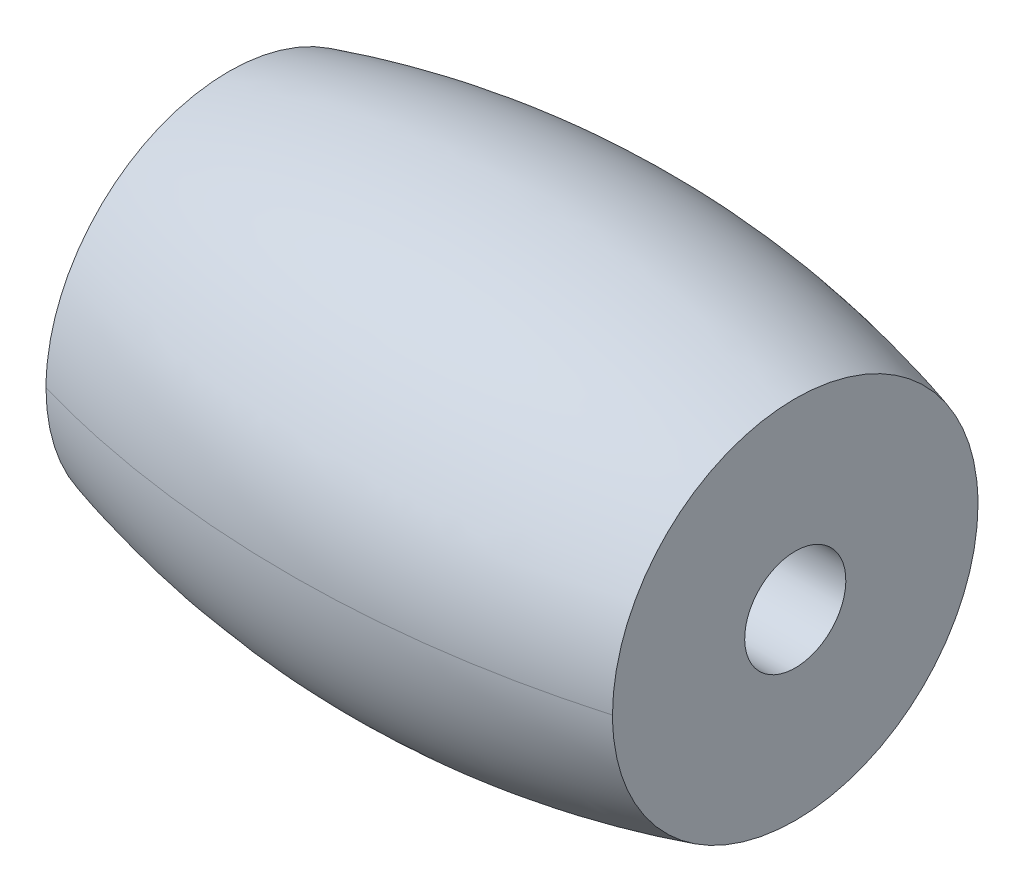
ISO-10303-21;
HEADER;
FILE_DESCRIPTION(('STEP AP214'),'2;1');
FILE_NAME('part.step','',(''),(''),'','','');
FILE_SCHEMA(('AUTOMOTIVE_DESIGN { 1 0 10303 214 1 1 1 1 }'));
ENDSEC;
DATA;
#1=APPLICATION_CONTEXT('core data for automotive mechanical design processes');
#2=APPLICATION_PROTOCOL_DEFINITION('international standard','automotive_design',2000,#1);
#3=PRODUCT_CONTEXT('',#1,'mechanical');
#4=PRODUCT('Part','Part','',(#3));
#5=PRODUCT_RELATED_PRODUCT_CATEGORY('part','',(#4));
#6=PRODUCT_DEFINITION_FORMATION('','',#4);
#7=PRODUCT_DEFINITION_CONTEXT('part definition',#1,'design');
#8=PRODUCT_DEFINITION('design','',#6,#7);
#9=PRODUCT_DEFINITION_SHAPE('','',#8);
#10=(LENGTH_UNIT() NAMED_UNIT(*) SI_UNIT(.MILLI.,.METRE.));
#11=(NAMED_UNIT(*) PLANE_ANGLE_UNIT() SI_UNIT($,.RADIAN.));
#12=(NAMED_UNIT(*) SI_UNIT($,.STERADIAN.) SOLID_ANGLE_UNIT());
#13=UNCERTAINTY_MEASURE_WITH_UNIT(LENGTH_MEASURE(1.E-05),#10,'distance_accuracy_value','');
#14=(GEOMETRIC_REPRESENTATION_CONTEXT(3) GLOBAL_UNCERTAINTY_ASSIGNED_CONTEXT((#13)) GLOBAL_UNIT_ASSIGNED_CONTEXT((#10,
#11,#12)) REPRESENTATION_CONTEXT('',''));
#15=CARTESIAN_POINT('',(0.,0.,0.));
#16=DIRECTION('',(0.,0.,1.));
#17=DIRECTION('',(1.,0.,0.));
#18=AXIS2_PLACEMENT_3D('',#15,#16,#17);
#19=CARTESIAN_POINT('',(7.,19.9,4.516387939));
#20=CARTESIAN_POINT('',(7.,10.867224121,4.516387939));
#21=CARTESIAN_POINT('',(7.,10.867224121,-4.516387939));
#22=CARTESIAN_POINT('',(7.,19.9,-4.516387939));
#23=CARTESIAN_POINT('',(2.395168413,19.9,5.836559506));
#24=CARTESIAN_POINT('',(2.395168413,8.226880989,5.836559506));
#25=CARTESIAN_POINT('',(2.395168413,8.226880989,-5.836559506));
#26=CARTESIAN_POINT('',(2.395168413,19.9,-5.836559506));
#27=CARTESIAN_POINT('',(-2.395168413,19.9,5.836559506));
#28=CARTESIAN_POINT('',(-2.395168413,8.226880989,5.836559506));
#29=CARTESIAN_POINT('',(-2.395168413,8.226880989,-5.836559506));
#30=CARTESIAN_POINT('',(-2.395168413,19.9,-5.836559506));
#31=CARTESIAN_POINT('',(-7.,19.9,4.516387939));
#32=CARTESIAN_POINT('',(-7.,10.867224121,4.516387939));
#33=CARTESIAN_POINT('',(-7.,10.867224121,-4.516387939));
#34=CARTESIAN_POINT('',(-7.,19.9,-4.516387939));
#35=(BOUNDED_SURFACE() B_SPLINE_SURFACE(3,3,((#19,#20,#21,#22),(#23,#24,#25,#26),(#27,#28,#29,
#30),(#31,#32,#33,#34)),.UNSPECIFIED.,.F.,.F.,.F.) B_SPLINE_SURFACE_WITH_KNOTS((4,4),(4,4),(0.,
1.),(0.,1.),.UNSPECIFIED.) GEOMETRIC_REPRESENTATION_ITEM() RATIONAL_B_SPLINE_SURFACE(((1.,
0.333333333333333,0.333333333333333,1.),(0.974183410479028,0.324727803493009,0.324727803493009,
0.974183410479028),(0.974183410479028,0.324727803493009,0.324727803493009,0.974183410479028),
(1.,0.333333333333333,0.333333333333333,1.))) REPRESENTATION_ITEM('') SURFACE());
#36=CARTESIAN_POINT('',(7.,19.9,-4.516387939));
#37=CARTESIAN_POINT('',(2.395168413,19.9,-5.836559506));
#38=CARTESIAN_POINT('',(-2.395168413,19.9,-5.836559506));
#39=CARTESIAN_POINT('',(-7.,19.9,-4.516387939));
#40=(BOUNDED_CURVE() B_SPLINE_CURVE(3,(#36,#37,#38,#39),.UNSPECIFIED.,.F.,
.F.) B_SPLINE_CURVE_WITH_KNOTS((4,4),(0.,1.),
.UNSPECIFIED.) CURVE() GEOMETRIC_REPRESENTATION_ITEM() RATIONAL_B_SPLINE_CURVE((1.,
0.974183410479028,0.974183410479028,1.)) REPRESENTATION_ITEM(''));
#41=CARTESIAN_POINT('',(7.,19.9,-4.516387939));
#42=VERTEX_POINT('',#41);
#43=CARTESIAN_POINT('',(-7.,19.9,-4.516387939));
#44=VERTEX_POINT('',#43);
#45=EDGE_CURVE('E52',#42,#44,#40,.T.);
#46=CARTESIAN_POINT('',(7.,19.9,-4.516387939));
#47=CARTESIAN_POINT('',(7.,19.7729751648833,-4.51640159673756));
#48=CARTESIAN_POINT('',(7.,19.6459522931038,-4.51102959194));
#49=CARTESIAN_POINT('',(7.,19.3928153096737,-4.48961290198438));
#50=CARTESIAN_POINT('',(7.,19.2667011548022,-4.47356872785502));
#51=CARTESIAN_POINT('',(7.,19.0163621174745,-4.43092132055707));
#52=CARTESIAN_POINT('',(7.,18.892135969324,-4.4043255174868));
#53=CARTESIAN_POINT('',(7.,18.6463659665743,-4.34076833961015));
#54=CARTESIAN_POINT('',(7.,18.5248220794003,-4.30380709076226));
#55=CARTESIAN_POINT('',(7.,18.2852442976578,-4.21976827385078));
#56=CARTESIAN_POINT('',(7.,18.167211418387,-4.17268781131836));
#57=CARTESIAN_POINT('',(7.,17.9354881222293,-4.06873253837329));
#58=CARTESIAN_POINT('',(7.,17.8217993258206,-4.01185411576629));
#59=CARTESIAN_POINT('',(7.,17.5996819503382,-3.88875433273147));
#60=CARTESIAN_POINT('',(7.,17.4912504316352,-3.82253827636791));
#61=CARTESIAN_POINT('',(7.,17.2803102476377,-3.68118333811818));
#62=CARTESIAN_POINT('',(7.,17.1778037830855,-3.60604117206736));
#63=CARTESIAN_POINT('',(7.,16.9795204518188,-3.44741544728942));
#64=CARTESIAN_POINT('',(7.,16.8837412625771,-3.36393479169432));
#65=CARTESIAN_POINT('',(7.,16.6995198851023,-3.18917119821299));
#66=CARTESIAN_POINT('',(7.,16.6110804192318,-3.09788539059502));
#67=CARTESIAN_POINT('',(7.,16.4422252195474,-2.90820778794242));
#68=CARTESIAN_POINT('',(7.,16.3618077516524,-2.80981753660691));
#69=CARTESIAN_POINT('',(7.,16.2095181829972,-2.60657529745303));
#70=CARTESIAN_POINT('',(7.,16.1376492489454,-2.50172093678107));
#71=CARTESIAN_POINT('',(7.,16.0030303221981,-2.28637374127166));
#72=CARTESIAN_POINT('',(7.,15.9402765731438,-2.17588325458546));
#73=CARTESIAN_POINT('',(7.,15.8242771963529,-1.94996744016067));
#74=CARTESIAN_POINT('',(7.,15.7710350867623,-1.8345403059492));
#75=CARTESIAN_POINT('',(7.,15.6744870689274,-1.59966120670978));
#76=CARTESIAN_POINT('',(7.,15.6311768732621,-1.48021100400131));
#77=CARTESIAN_POINT('',(7.,15.5547568820231,-1.23804262883616));
#78=CARTESIAN_POINT('',(7.,15.5216508461452,-1.11532326991713));
#79=CARTESIAN_POINT('',(7.,15.4659056333206,-0.867573418915544));
#80=CARTESIAN_POINT('',(7.,15.4432629304349,-0.742543720164557));
#81=CARTESIAN_POINT('',(7.,15.4085827887488,-0.490977681574806));
#82=CARTESIAN_POINT('',(7.,15.3965490406356,-0.36444083292568));
#83=CARTESIAN_POINT('',(7.,15.3831868272065,-0.110822322245486));
#84=CARTESIAN_POINT('',(7.,15.381856748042,0.0162592547629603));
#85=CARTESIAN_POINT('',(7.,15.3899070810211,0.270082712146288));
#86=CARTESIAN_POINT('',(7.,15.3992874932217,0.396824592519366));
#87=CARTESIAN_POINT('',(7.,15.4286945432784,0.649088282946617));
#88=CARTESIAN_POINT('',(7.,15.4487229258584,0.774609889619529));
#89=CARTESIAN_POINT('',(7.,15.4992757415498,1.02347589511249));
#90=CARTESIAN_POINT('',(7.,15.529796523576,1.1468210356111));
#91=CARTESIAN_POINT('',(7.,15.6011314026388,1.39054560331667));
#92=CARTESIAN_POINT('',(7.,15.641949146961,1.51092396304108));
#93=CARTESIAN_POINT('',(7.,15.7335653915954,1.74776976144102));
#94=CARTESIAN_POINT('',(7.,15.7843602144618,1.86423862265153));
#95=CARTESIAN_POINT('',(7.,15.895601156348,2.09252934372251));
#96=CARTESIAN_POINT('',(7.,15.9560510784663,2.20434935045593));
#97=CARTESIAN_POINT('',(7.,16.086133838824,2.42245788781974));
#98=CARTESIAN_POINT('',(7.,16.1557632799895,2.5287484445442));
#99=CARTESIAN_POINT('',(7.,16.3037511746016,2.7351200980187));
#100=CARTESIAN_POINT('',(7.,16.3821124130562,2.8351991976857));
#101=CARTESIAN_POINT('',(7.,16.5469580043105,3.02836343481878));
#102=CARTESIAN_POINT('',(7.,16.6334393479379,3.12145114033799));
#103=CARTESIAN_POINT('',(7.,16.8139562544225,3.30003291236185));
#104=CARTESIAN_POINT('',(7.,16.9079935845942,3.38552519242371));
#105=CARTESIAN_POINT('',(7.,17.1029001699545,3.54825364387103));
#106=CARTESIAN_POINT('',(7.,17.2037668918145,3.62549284957859));
#107=CARTESIAN_POINT('',(7.,17.4117181860578,3.77125272519666));
#108=CARTESIAN_POINT('',(7.,17.5188069870377,3.83976736242896));
#109=CARTESIAN_POINT('',(7.,17.7383369074483,3.96750479073464));
#110=CARTESIAN_POINT('',(7.,17.8507760365421,4.02673100244624));
#111=CARTESIAN_POINT('',(7.,18.0803564054436,4.1355544556805));
#112=CARTESIAN_POINT('',(7.,18.1975021534516,4.18514218627831));
#113=CARTESIAN_POINT('',(7.,18.435513881342,4.27424624500391));
#114=CARTESIAN_POINT('',(7.,18.5563784456015,4.31376635363823));
#115=CARTESIAN_POINT('',(7.,18.8008704569381,4.38244012705406));
#116=CARTESIAN_POINT('',(7.,18.9244947131807,4.41160516548883));
#117=CARTESIAN_POINT('',(7.,19.1737109053091,4.45941145911127));
#118=CARTESIAN_POINT('',(7.,19.2993018441055,4.47805788024886));
#119=CARTESIAN_POINT('',(7.,19.5043050953678,4.49971994857918));
#120=CARTESIAN_POINT('',(7.,19.5833892533729,4.50597442899889));
#121=CARTESIAN_POINT('',(7.,19.7416461966431,4.51430543095316));
#122=CARTESIAN_POINT('',(7.,19.820818619263,4.51638884220867));
#123=CARTESIAN_POINT('',(7.,19.9,4.516387939));
#124=B_SPLINE_CURVE_WITH_KNOTS('',3,(#46,#47,#48,#49,#50,#51,#52,#53,#54,#55,#56,#57,#58,#59,
#60,#61,#62,#63,#64,#65,#66,#67,#68,#69,#70,#71,#72,#73,#74,#75,#76,#77,#78,#79,#80,#81,#82,#83,
#84,#85,#86,#87,#88,#89,#90,#91,#92,#93,#94,#95,#96,#97,#98,#99,#100,#101,#102,#103,#104,#105,
#106,#107,#108,#109,#110,#111,#112,#113,#114,#115,#116,#117,#118,#119,#120,#121,#122,#123),
.UNSPECIFIED.,.F.,.F.,(4,2,2,2,2,2,2,2,2,2,2,2,2,2,2,2,2,2,2,2,2,2,2,2,2,2,2,2,2,2,2,2,2,2,2,2,
2,2,4),(0.,0.380958192129953,0.761898143679951,1.14257032502025,1.52323788072024,
1.90401446664994,2.28493173434005,2.66563349436249,3.04647576156624,3.42718589370098,
3.80803660901416,4.18880481823044,4.56971364234561,4.95046504622623,5.33135699138984,
5.71208420182319,6.09295152297124,6.47369040550699,6.85456168885535,7.2353755451529,
7.61618940347316,7.99706567931083,8.3778095539246,8.75868848159891,9.13942728387773,
9.52031642893226,9.90106501156788,10.2819353835101,10.6626651643127,11.0434842569334,
11.4241628524685,11.8051032584597,12.1859030448418,12.5670767048282,12.9481070180779,
13.3287175165254,13.7091409247519,13.9470331209038,14.1845320443632),.UNSPECIFIED.);
#125=CARTESIAN_POINT('',(7.,19.9,4.516387939));
#126=VERTEX_POINT('',#125);
#127=EDGE_CURVE('E60',#42,#126,#124,.T.);
#128=CARTESIAN_POINT('',(7.,19.9,4.516387939));
#129=CARTESIAN_POINT('',(2.395168413,19.9,5.836559506));
#130=CARTESIAN_POINT('',(-2.395168413,19.9,5.836559506));
#131=CARTESIAN_POINT('',(-7.,19.9,4.516387939));
#132=(BOUNDED_CURVE() B_SPLINE_CURVE(3,(#128,#129,#130,#131),.UNSPECIFIED.,.F.,
.F.) B_SPLINE_CURVE_WITH_KNOTS((4,4),(0.,1.),
.UNSPECIFIED.) CURVE() GEOMETRIC_REPRESENTATION_ITEM() RATIONAL_B_SPLINE_CURVE((1.,
0.974183410479028,0.974183410479028,1.)) REPRESENTATION_ITEM(''));
#133=CARTESIAN_POINT('',(-7.,19.9,4.516387939));
#134=VERTEX_POINT('',#133);
#135=EDGE_CURVE('E41',#134,#126,#132,.F.);
#136=CARTESIAN_POINT('',(-7.,19.9,4.516387939));
#137=CARTESIAN_POINT('',(-7.,19.7729751648833,4.51640159673756));
#138=CARTESIAN_POINT('',(-7.,19.6459522931038,4.51102959194));
#139=CARTESIAN_POINT('',(-7.,19.3928153096737,4.48961290198438));
#140=CARTESIAN_POINT('',(-7.,19.2667011548022,4.47356872785502));
#141=CARTESIAN_POINT('',(-7.,19.0163621174745,4.43092132055707));
#142=CARTESIAN_POINT('',(-7.,18.892135969324,4.4043255174868));
#143=CARTESIAN_POINT('',(-7.,18.6463659665743,4.34076833961015));
#144=CARTESIAN_POINT('',(-7.,18.5248220794004,4.30380709076226));
#145=CARTESIAN_POINT('',(-7.,18.2852442976578,4.21976827385078));
#146=CARTESIAN_POINT('',(-7.,18.167211418387,4.17268781131836));
#147=CARTESIAN_POINT('',(-7.,17.9354881222293,4.06873253837329));
#148=CARTESIAN_POINT('',(-7.,17.8217993258206,4.0118541157663));
#149=CARTESIAN_POINT('',(-7.,17.5996819503382,3.88875433273147));
#150=CARTESIAN_POINT('',(-7.,17.4912504316352,3.82253827636792));
#151=CARTESIAN_POINT('',(-7.,17.2803102476377,3.68118333811819));
#152=CARTESIAN_POINT('',(-7.,17.1778037830855,3.60604117206736));
#153=CARTESIAN_POINT('',(-7.,16.9795204518188,3.44741544728942));
#154=CARTESIAN_POINT('',(-7.,16.8837412625771,3.36393479169433));
#155=CARTESIAN_POINT('',(-7.,16.6995198851023,3.189171198213));
#156=CARTESIAN_POINT('',(-7.,16.6110804192318,3.09788539059503));
#157=CARTESIAN_POINT('',(-7.,16.4422252195474,2.90820778794243));
#158=CARTESIAN_POINT('',(-7.,16.3618077516524,2.80981753660692));
#159=CARTESIAN_POINT('',(-7.,16.2095181829972,2.60657529745304));
#160=CARTESIAN_POINT('',(-7.,16.1376492489454,2.50172093678108));
#161=CARTESIAN_POINT('',(-7.,16.0030303221981,2.28637374127167));
#162=CARTESIAN_POINT('',(-7.,15.9402765731438,2.17588325458547));
#163=CARTESIAN_POINT('',(-7.,15.8242771963529,1.94996744016068));
#164=CARTESIAN_POINT('',(-7.,15.7710350867623,1.8345403059492));
#165=CARTESIAN_POINT('',(-7.,15.6744870689274,1.59966120670978));
#166=CARTESIAN_POINT('',(-7.,15.6311768732621,1.48021100400132));
#167=CARTESIAN_POINT('',(-7.,15.5547568820231,1.23804262883617));
#168=CARTESIAN_POINT('',(-7.,15.5216508461452,1.11532326991714));
#169=CARTESIAN_POINT('',(-7.,15.4659056333206,0.867573418915549));
#170=CARTESIAN_POINT('',(-7.,15.4432629304349,0.742543720164562));
#171=CARTESIAN_POINT('',(-7.,15.4085827887488,0.49097768157481));
#172=CARTESIAN_POINT('',(-7.,15.3965490406356,0.364440832925685));
#173=CARTESIAN_POINT('',(-7.,15.3831868272065,0.11082232224549));
#174=CARTESIAN_POINT('',(-7.,15.381856748042,-0.0162592547629555));
#175=CARTESIAN_POINT('',(-7.,15.3899070810211,-0.270082712146284));
#176=CARTESIAN_POINT('',(-7.,15.3992874932217,-0.396824592519362));
#177=CARTESIAN_POINT('',(-7.,15.4286945432784,-0.649088282946613));
#178=CARTESIAN_POINT('',(-7.,15.4487229258584,-0.774609889619524));
#179=CARTESIAN_POINT('',(-7.,15.4992757415498,-1.02347589511249));
#180=CARTESIAN_POINT('',(-7.,15.529796523576,-1.1468210356111));
#181=CARTESIAN_POINT('',(-7.,15.6011314026388,-1.39054560331667));
#182=CARTESIAN_POINT('',(-7.,15.641949146961,-1.51092396304108));
#183=CARTESIAN_POINT('',(-7.,15.7335653915954,-1.74776976144102));
#184=CARTESIAN_POINT('',(-7.,15.7843602144618,-1.86423862265153));
#185=CARTESIAN_POINT('',(-7.,15.895601156348,-2.09252934372251));
#186=CARTESIAN_POINT('',(-7.,15.9560510784663,-2.20434935045593));
#187=CARTESIAN_POINT('',(-7.,16.086133838824,-2.42245788781974));
#188=CARTESIAN_POINT('',(-7.,16.1557632799895,-2.5287484445442));
#189=CARTESIAN_POINT('',(-7.,16.3037511746016,-2.7351200980187));
#190=CARTESIAN_POINT('',(-7.,16.3821124130562,-2.8351991976857));
#191=CARTESIAN_POINT('',(-7.,16.5469580043105,-3.02836343481878));
#192=CARTESIAN_POINT('',(-7.,16.6334393479379,-3.12145114033799));
#193=CARTESIAN_POINT('',(-7.,16.8139562544225,-3.30003291236185));
#194=CARTESIAN_POINT('',(-7.,16.9079935845942,-3.38552519242371));
#195=CARTESIAN_POINT('',(-7.,17.1029001699545,-3.54825364387103));
#196=CARTESIAN_POINT('',(-7.,17.2037668918145,-3.62549284957859));
#197=CARTESIAN_POINT('',(-7.,17.4117181860578,-3.77125272519667));
#198=CARTESIAN_POINT('',(-7.,17.5188069870377,-3.83976736242897));
#199=CARTESIAN_POINT('',(-7.,17.7383369074483,-3.96750479073464));
#200=CARTESIAN_POINT('',(-7.,17.8507760365421,-4.02673100244624));
#201=CARTESIAN_POINT('',(-7.,18.0803564054436,-4.13555445568051));
#202=CARTESIAN_POINT('',(-7.,18.1975021534516,-4.18514218627831));
#203=CARTESIAN_POINT('',(-7.,18.435513881342,-4.27424624500391));
#204=CARTESIAN_POINT('',(-7.,18.5563784456015,-4.31376635363823));
#205=CARTESIAN_POINT('',(-7.,18.8008704569381,-4.38244012705406));
#206=CARTESIAN_POINT('',(-7.,18.9244947131807,-4.41160516548883));
#207=CARTESIAN_POINT('',(-7.,19.1737109053091,-4.45941145911127));
#208=CARTESIAN_POINT('',(-7.,19.2993018441055,-4.47805788024886));
#209=CARTESIAN_POINT('',(-7.,19.5043050953678,-4.49971994857918));
#210=CARTESIAN_POINT('',(-7.,19.5833892533729,-4.50597442899889));
#211=CARTESIAN_POINT('',(-7.,19.7416461966431,-4.51430543095316));
#212=CARTESIAN_POINT('',(-7.,19.820818619263,-4.51638884220867));
#213=CARTESIAN_POINT('',(-7.,19.9,-4.516387939));
#214=B_SPLINE_CURVE_WITH_KNOTS('',3,(#136,#137,#138,#139,#140,#141,#142,#143,#144,#145,#146,
#147,#148,#149,#150,#151,#152,#153,#154,#155,#156,#157,#158,#159,#160,#161,#162,#163,#164,#165,
#166,#167,#168,#169,#170,#171,#172,#173,#174,#175,#176,#177,#178,#179,#180,#181,#182,#183,#184,
#185,#186,#187,#188,#189,#190,#191,#192,#193,#194,#195,#196,#197,#198,#199,#200,#201,#202,#203,
#204,#205,#206,#207,#208,#209,#210,#211,#212,#213),.UNSPECIFIED.,.F.,.F.,(4,2,2,2,2,2,2,2,2,2,2,
2,2,2,2,2,2,2,2,2,2,2,2,2,2,2,2,2,2,2,2,2,2,2,2,2,2,2,4),(0.,0.38095819212995,0.761898143679947,
1.14257032502024,1.52323788072024,1.90401446664993,2.28493173434004,2.66563349436248,
3.04647576156623,3.42718589370097,3.80803660901415,4.18880481823043,4.5697136423456,
4.95046504622622,5.33135699138983,5.71208420182318,6.09295152297123,6.47369040550699,
6.85456168885535,7.2353755451529,7.61618940347315,7.99706567931082,8.37780955392459,
8.75868848159891,9.13942728387772,9.52031642893225,9.90106501156788,10.2819353835101,
10.6626651643127,11.0434842569334,11.4241628524685,11.8051032584597,12.1859030448418,
12.5670767048282,12.9481070180779,13.3287175165254,13.7091409247519,13.9470331209038,
14.1845320443632),.UNSPECIFIED.);
#215=EDGE_CURVE('E22',#134,#44,#214,.T.);
#216=ORIENTED_EDGE('',*,*,#45,.F.);
#217=ORIENTED_EDGE('',*,*,#127,.T.);
#218=ORIENTED_EDGE('',*,*,#135,.F.);
#219=ORIENTED_EDGE('',*,*,#215,.T.);
#220=EDGE_LOOP('',(#216,#217,#218,#219));
#221=FACE_BOUND('',#220,.T.);
#222=ADVANCED_FACE('F17',(#221),#35,.T.);
#223=CARTESIAN_POINT('',(7.,19.9,-4.516387939));
#224=CARTESIAN_POINT('',(7.,28.932775879,-4.516387939));
#225=CARTESIAN_POINT('',(7.,28.932775879,4.516387939));
#226=CARTESIAN_POINT('',(7.,19.9,4.516387939));
#227=CARTESIAN_POINT('',(2.395168413,19.9,-5.836559506));
#228=CARTESIAN_POINT('',(2.395168413,31.573119011,-5.836559506));
#229=CARTESIAN_POINT('',(2.395168413,31.573119011,5.836559506));
#230=CARTESIAN_POINT('',(2.395168413,19.9,5.836559506));
#231=CARTESIAN_POINT('',(-2.395168413,19.9,-5.836559506));
#232=CARTESIAN_POINT('',(-2.395168413,31.573119011,-5.836559506));
#233=CARTESIAN_POINT('',(-2.395168413,31.573119011,5.836559506));
#234=CARTESIAN_POINT('',(-2.395168413,19.9,5.836559506));
#235=CARTESIAN_POINT('',(-7.,19.9,-4.516387939));
#236=CARTESIAN_POINT('',(-7.,28.932775879,-4.516387939));
#237=CARTESIAN_POINT('',(-7.,28.932775879,4.516387939));
#238=CARTESIAN_POINT('',(-7.,19.9,4.516387939));
#239=(BOUNDED_SURFACE() B_SPLINE_SURFACE(3,3,((#223,#224,#225,#226),(#227,#228,#229,#230),(#231,
#232,#233,#234),(#235,#236,#237,#238)),.UNSPECIFIED.,.F.,.F.,
.F.) B_SPLINE_SURFACE_WITH_KNOTS((4,4),(4,4),(0.,1.),(0.,1.),
.UNSPECIFIED.) GEOMETRIC_REPRESENTATION_ITEM() RATIONAL_B_SPLINE_SURFACE(((1.,0.333333333333333,
0.333333333333333,1.),(0.974183410479028,0.324727803493009,0.324727803493009,0.974183410479028),
(0.974183410479028,0.324727803493009,0.324727803493009,0.974183410479028),(1.,0.333333333333333,
0.333333333333333,1.))) REPRESENTATION_ITEM('') SURFACE());
#240=CARTESIAN_POINT('',(7.,19.9,4.516387939));
#241=CARTESIAN_POINT('',(7.,20.0270248351167,4.51640159673756));
#242=CARTESIAN_POINT('',(7.,20.1540477068962,4.51102959194));
#243=CARTESIAN_POINT('',(7.,20.4071846903263,4.48961290198438));
#244=CARTESIAN_POINT('',(7.,20.5332988451978,4.47356872785503));
#245=CARTESIAN_POINT('',(7.,20.7836378825255,4.43092132055707));
#246=CARTESIAN_POINT('',(7.,20.907864030676,4.4043255174868));
#247=CARTESIAN_POINT('',(7.,21.1536340334257,4.34076833961015));
#248=CARTESIAN_POINT('',(7.,21.2751779205996,4.30380709076226));
#249=CARTESIAN_POINT('',(7.,21.5147557023422,4.21976827385078));
#250=CARTESIAN_POINT('',(7.,21.632788581613,4.17268781131836));
#251=CARTESIAN_POINT('',(7.,21.8645118777707,4.06873253837329));
#252=CARTESIAN_POINT('',(7.,21.9782006741794,4.0118541157663));
#253=CARTESIAN_POINT('',(7.,22.2003180496618,3.88875433273147));
#254=CARTESIAN_POINT('',(7.,22.3087495683648,3.82253827636792));
#255=CARTESIAN_POINT('',(7.,22.5196897523623,3.68118333811819));
#256=CARTESIAN_POINT('',(7.,22.6221962169145,3.60604117206736));
#257=CARTESIAN_POINT('',(7.,22.8204795481812,3.44741544728942));
#258=CARTESIAN_POINT('',(7.,22.9162587374229,3.36393479169433));
#259=CARTESIAN_POINT('',(7.,23.1004801148977,3.189171198213));
#260=CARTESIAN_POINT('',(7.,23.1889195807682,3.09788539059502));
#261=CARTESIAN_POINT('',(7.,23.3577747804526,2.90820778794242));
#262=CARTESIAN_POINT('',(7.,23.4381922483476,2.80981753660692));
#263=CARTESIAN_POINT('',(7.,23.5904818170028,2.60657529745303));
#264=CARTESIAN_POINT('',(7.,23.6623507510546,2.50172093678107));
#265=CARTESIAN_POINT('',(7.,23.7969696778019,2.28637374127166));
#266=CARTESIAN_POINT('',(7.,23.8597234268562,2.17588325458546));
#267=CARTESIAN_POINT('',(7.,23.9757228036471,1.94996744016067));
#268=CARTESIAN_POINT('',(7.,24.0289649132377,1.83454030594919));
#269=CARTESIAN_POINT('',(7.,24.1255129310726,1.59966120670977));
#270=CARTESIAN_POINT('',(7.,24.1688231267379,1.48021100400131));
#271=CARTESIAN_POINT('',(7.,24.2452431179769,1.23804262883616));
#272=CARTESIAN_POINT('',(7.,24.2783491538548,1.11532326991713));
#273=CARTESIAN_POINT('',(7.,24.3340943666794,0.867573418915538));
#274=CARTESIAN_POINT('',(7.,24.3567370695651,0.742543720164551));
#275=CARTESIAN_POINT('',(7.,24.3914172112512,0.4909776815748));
#276=CARTESIAN_POINT('',(7.,24.4034509593644,0.364440832925675));
#277=CARTESIAN_POINT('',(7.,24.4168131727935,0.110822322245481));
#278=CARTESIAN_POINT('',(7.,24.418143251958,-0.0162592547629642));
#279=CARTESIAN_POINT('',(7.,24.4100929189789,-0.270082712146291));
#280=CARTESIAN_POINT('',(7.,24.4007125067783,-0.396824592519369));
#281=CARTESIAN_POINT('',(7.,24.3713054567216,-0.64908828294662));
#282=CARTESIAN_POINT('',(7.,24.3512770741416,-0.774609889619532));
#283=CARTESIAN_POINT('',(7.,24.3007242584502,-1.02347589511249));
#284=CARTESIAN_POINT('',(7.,24.270203476424,-1.14682103561111));
#285=CARTESIAN_POINT('',(7.,24.1988685973612,-1.39054560331667));
#286=CARTESIAN_POINT('',(7.,24.158050853039,-1.51092396304108));
#287=CARTESIAN_POINT('',(7.,24.0664346084046,-1.74776976144102));
#288=CARTESIAN_POINT('',(7.,24.0156397855382,-1.86423862265153));
#289=CARTESIAN_POINT('',(7.,23.904398843652,-2.09252934372252));
#290=CARTESIAN_POINT('',(7.,23.8439489215337,-2.20434935045594));
#291=CARTESIAN_POINT('',(7.,23.713866161176,-2.42245788781974));
#292=CARTESIAN_POINT('',(7.,23.6442367200105,-2.52874844454421));
#293=CARTESIAN_POINT('',(7.,23.4962488253984,-2.7351200980187));
#294=CARTESIAN_POINT('',(7.,23.4178875869438,-2.83519919768571));
#295=CARTESIAN_POINT('',(7.,23.2530419956895,-3.02836343481878));
#296=CARTESIAN_POINT('',(7.,23.1665606520621,-3.12145114033799));
#297=CARTESIAN_POINT('',(7.,22.9860437455774,-3.30003291236185));
#298=CARTESIAN_POINT('',(7.,22.8920064154058,-3.38552519242372));
#299=CARTESIAN_POINT('',(7.,22.6970998300455,-3.54825364387104));
#300=CARTESIAN_POINT('',(7.,22.5962331081855,-3.6254928495786));
#301=CARTESIAN_POINT('',(7.,22.3882818139422,-3.77125272519667));
#302=CARTESIAN_POINT('',(7.,22.2811930129623,-3.83976736242897));
#303=CARTESIAN_POINT('',(7.,22.0616630925517,-3.96750479073464));
#304=CARTESIAN_POINT('',(7.,21.9492239634579,-4.02673100244624));
#305=CARTESIAN_POINT('',(7.,21.7196435945563,-4.13555445568051));
#306=CARTESIAN_POINT('',(7.,21.6024978465484,-4.18514218627831));
#307=CARTESIAN_POINT('',(7.,21.364486118658,-4.27424624500391));
#308=CARTESIAN_POINT('',(7.,21.2436215543985,-4.31376635363823));
#309=CARTESIAN_POINT('',(7.,20.9991295430619,-4.38244012705406));
#310=CARTESIAN_POINT('',(7.,20.8755052868193,-4.41160516548883));
#311=CARTESIAN_POINT('',(7.,20.6262890946909,-4.45941145911127));
#312=CARTESIAN_POINT('',(7.,20.5006981558945,-4.47805788024886));
#313=CARTESIAN_POINT('',(7.,20.2956949046321,-4.49971994857918));
#314=CARTESIAN_POINT('',(7.,20.2166107466271,-4.50597442899889));
#315=CARTESIAN_POINT('',(7.,20.0583538033568,-4.51430543095316));
#316=CARTESIAN_POINT('',(7.,19.979181380737,-4.51638884220867));
#317=CARTESIAN_POINT('',(7.,19.9,-4.516387939));
#318=B_SPLINE_CURVE_WITH_KNOTS('',3,(#240,#241,#242,#243,#244,#245,#246,#247,#248,#249,#250,
#251,#252,#253,#254,#255,#256,#257,#258,#259,#260,#261,#262,#263,#264,#265,#266,#267,#268,#269,
#270,#271,#272,#273,#274,#275,#276,#277,#278,#279,#280,#281,#282,#283,#284,#285,#286,#287,#288,
#289,#290,#291,#292,#293,#294,#295,#296,#297,#298,#299,#300,#301,#302,#303,#304,#305,#306,#307,
#308,#309,#310,#311,#312,#313,#314,#315,#316,#317),.UNSPECIFIED.,.F.,.F.,(4,2,2,2,2,2,2,2,2,2,2,
2,2,2,2,2,2,2,2,2,2,2,2,2,2,2,2,2,2,2,2,2,2,2,2,2,2,2,4),(0.,0.380958192129953,0.76189814367995,
1.14257032502025,1.52323788072024,1.90401446664994,2.28493173434004,2.66563349436249,
3.04647576156624,3.42718589370098,3.80803660901416,4.18880481823044,4.56971364234561,
4.95046504622624,5.33135699138985,5.71208420182319,6.09295152297125,6.473690405507,
6.85456168885536,7.23537554515291,7.61618940347316,7.99706567931083,8.3778095539246,
8.75868848159892,9.13942728387773,9.52031642893227,9.90106501156789,10.2819353835101,
10.6626651643127,11.0434842569334,11.4241628524685,11.8051032584597,12.1859030448418,
12.5670767048282,12.9481070180779,13.3287175165254,13.7091409247519,13.9470331209038,
14.1845320443632),.UNSPECIFIED.);
#319=EDGE_CURVE('E55',#126,#42,#318,.T.);
#320=CARTESIAN_POINT('',(-7.,19.9,-4.516387939));
#321=CARTESIAN_POINT('',(-7.,20.0270248351167,-4.51640159673756));
#322=CARTESIAN_POINT('',(-7.,20.1540477068962,-4.51102959194));
#323=CARTESIAN_POINT('',(-7.,20.4071846903263,-4.48961290198438));
#324=CARTESIAN_POINT('',(-7.,20.5332988451978,-4.47356872785502));
#325=CARTESIAN_POINT('',(-7.,20.7836378825255,-4.43092132055706));
#326=CARTESIAN_POINT('',(-7.,20.907864030676,-4.4043255174868));
#327=CARTESIAN_POINT('',(-7.,21.1536340334257,-4.34076833961014));
#328=CARTESIAN_POINT('',(-7.,21.2751779205997,-4.30380709076226));
#329=CARTESIAN_POINT('',(-7.,21.5147557023422,-4.21976827385078));
#330=CARTESIAN_POINT('',(-7.,21.632788581613,-4.17268781131835));
#331=CARTESIAN_POINT('',(-7.,21.8645118777707,-4.06873253837329));
#332=CARTESIAN_POINT('',(-7.,21.9782006741795,-4.01185411576629));
#333=CARTESIAN_POINT('',(-7.,22.2003180496618,-3.88875433273146));
#334=CARTESIAN_POINT('',(-7.,22.3087495683648,-3.82253827636791));
#335=CARTESIAN_POINT('',(-7.,22.5196897523623,-3.68118333811817));
#336=CARTESIAN_POINT('',(-7.,22.6221962169145,-3.60604117206735));
#337=CARTESIAN_POINT('',(-7.,22.8204795481812,-3.44741544728941));
#338=CARTESIAN_POINT('',(-7.,22.9162587374229,-3.36393479169431));
#339=CARTESIAN_POINT('',(-7.,23.1004801148977,-3.18917119821298));
#340=CARTESIAN_POINT('',(-7.,23.1889195807682,-3.09788539059501));
#341=CARTESIAN_POINT('',(-7.,23.3577747804526,-2.90820778794241));
#342=CARTESIAN_POINT('',(-7.,23.4381922483476,-2.8098175366069));
#343=CARTESIAN_POINT('',(-7.,23.5904818170028,-2.60657529745302));
#344=CARTESIAN_POINT('',(-7.,23.6623507510546,-2.50172093678106));
#345=CARTESIAN_POINT('',(-7.,23.7969696778019,-2.28637374127166));
#346=CARTESIAN_POINT('',(-7.,23.8597234268562,-2.17588325458545));
#347=CARTESIAN_POINT('',(-7.,23.9757228036471,-1.94996744016066));
#348=CARTESIAN_POINT('',(-7.,24.0289649132377,-1.83454030594918));
#349=CARTESIAN_POINT('',(-7.,24.1255129310726,-1.59966120670977));
#350=CARTESIAN_POINT('',(-7.,24.1688231267379,-1.4802110040013));
#351=CARTESIAN_POINT('',(-7.,24.2452431179769,-1.23804262883615));
#352=CARTESIAN_POINT('',(-7.,24.2783491538548,-1.11532326991712));
#353=CARTESIAN_POINT('',(-7.,24.3340943666794,-0.86757341891553));
#354=CARTESIAN_POINT('',(-7.,24.3567370695651,-0.742543720164543));
#355=CARTESIAN_POINT('',(-7.,24.3914172112512,-0.490977681574792));
#356=CARTESIAN_POINT('',(-7.,24.4034509593644,-0.364440832925666));
#357=CARTESIAN_POINT('',(-7.,24.4168131727935,-0.110822322245471));
#358=CARTESIAN_POINT('',(-7.,24.418143251958,0.016259254762974));
#359=CARTESIAN_POINT('',(-7.,24.4100929189789,0.270082712146301));
#360=CARTESIAN_POINT('',(-7.,24.4007125067783,0.396824592519379));
#361=CARTESIAN_POINT('',(-7.,24.3713054567216,0.649088282946629));
#362=CARTESIAN_POINT('',(-7.,24.3512770741416,0.774609889619539));
#363=CARTESIAN_POINT('',(-7.,24.3007242584502,1.0234758951125));
#364=CARTESIAN_POINT('',(-7.,24.270203476424,1.14682103561111));
#365=CARTESIAN_POINT('',(-7.,24.1988685973612,1.39054560331668));
#366=CARTESIAN_POINT('',(-7.,24.158050853039,1.51092396304109));
#367=CARTESIAN_POINT('',(-7.,24.0664346084046,1.74776976144104));
#368=CARTESIAN_POINT('',(-7.,24.0156397855382,1.86423862265154));
#369=CARTESIAN_POINT('',(-7.,23.904398843652,2.09252934372252));
#370=CARTESIAN_POINT('',(-7.,23.8439489215337,2.20434935045595));
#371=CARTESIAN_POINT('',(-7.,23.7138661611759,2.42245788781975));
#372=CARTESIAN_POINT('',(-7.,23.6442367200105,2.52874844454421));
#373=CARTESIAN_POINT('',(-7.,23.4962488253984,2.73512009801871));
#374=CARTESIAN_POINT('',(-7.,23.4178875869438,2.83519919768571));
#375=CARTESIAN_POINT('',(-7.,23.2530419956895,3.02836343481879));
#376=CARTESIAN_POINT('',(-7.,23.1665606520621,3.121451140338));
#377=CARTESIAN_POINT('',(-7.,22.9860437455774,3.30003291236186));
#378=CARTESIAN_POINT('',(-7.,22.8920064154058,3.38552519242372));
#379=CARTESIAN_POINT('',(-7.,22.6970998300455,3.54825364387104));
#380=CARTESIAN_POINT('',(-7.,22.5962331081855,3.6254928495786));
#381=CARTESIAN_POINT('',(-7.,22.3882818139422,3.77125272519667));
#382=CARTESIAN_POINT('',(-7.,22.2811930129623,3.83976736242897));
#383=CARTESIAN_POINT('',(-7.,22.0616630925517,3.96750479073464));
#384=CARTESIAN_POINT('',(-7.,21.9492239634579,4.02673100244624));
#385=CARTESIAN_POINT('',(-7.,21.7196435945564,4.13555445568051));
#386=CARTESIAN_POINT('',(-7.,21.6024978465484,4.18514218627831));
#387=CARTESIAN_POINT('',(-7.,21.364486118658,4.27424624500391));
#388=CARTESIAN_POINT('',(-7.,21.2436215543985,4.31376635363823));
#389=CARTESIAN_POINT('',(-7.,20.9991295430619,4.38244012705406));
#390=CARTESIAN_POINT('',(-7.,20.8755052868193,4.41160516548883));
#391=CARTESIAN_POINT('',(-7.,20.6262890946909,4.45941145911127));
#392=CARTESIAN_POINT('',(-7.,20.5006981558945,4.47805788024886));
#393=CARTESIAN_POINT('',(-7.,20.2956949046321,4.49971994857918));
#394=CARTESIAN_POINT('',(-7.,20.2166107466271,4.50597442899889));
#395=CARTESIAN_POINT('',(-7.,20.0583538033568,4.51430543095316));
#396=CARTESIAN_POINT('',(-7.,19.979181380737,4.51638884220867));
#397=CARTESIAN_POINT('',(-7.,19.9,4.516387939));
#398=B_SPLINE_CURVE_WITH_KNOTS('',3,(#320,#321,#322,#323,#324,#325,#326,#327,#328,#329,#330,
#331,#332,#333,#334,#335,#336,#337,#338,#339,#340,#341,#342,#343,#344,#345,#346,#347,#348,#349,
#350,#351,#352,#353,#354,#355,#356,#357,#358,#359,#360,#361,#362,#363,#364,#365,#366,#367,#368,
#369,#370,#371,#372,#373,#374,#375,#376,#377,#378,#379,#380,#381,#382,#383,#384,#385,#386,#387,
#388,#389,#390,#391,#392,#393,#394,#395,#396,#397),.UNSPECIFIED.,.F.,.F.,(4,2,2,2,2,2,2,2,2,2,2,
2,2,2,2,2,2,2,2,2,2,2,2,2,2,2,2,2,2,2,2,2,2,2,2,2,2,2,4),(0.,0.380958192129953,
0.761898143679951,1.14257032502025,1.52323788072026,1.90401446664996,2.28493173434006,
2.66563349436251,3.04647576156626,3.42718589370099,3.80803660901418,4.18880481823045,
4.56971364234562,4.95046504622624,5.33135699138985,5.7120842018232,6.09295152297126,
6.47369040550701,6.85456168885537,7.23537554515292,7.61618940347317,7.99706567931084,
8.37780955392461,8.75868848159893,9.13942728387774,9.52031642893227,9.9010650115679,
10.2819353835101,10.6626651643127,11.0434842569334,11.4241628524685,11.8051032584597,
12.1859030448418,12.5670767048282,12.9481070180779,13.3287175165254,13.7091409247519,
13.9470331209038,14.1845320443632),.UNSPECIFIED.);
#399=EDGE_CURVE('E54',#44,#134,#398,.T.);
#400=ORIENTED_EDGE('',*,*,#319,.T.);
#401=ORIENTED_EDGE('',*,*,#45,.T.);
#402=ORIENTED_EDGE('',*,*,#399,.T.);
#403=ORIENTED_EDGE('',*,*,#135,.T.);
#404=EDGE_LOOP('',(#400,#401,#402,#403));
#405=FACE_BOUND('',#404,.T.);
#406=ADVANCED_FACE('F53',(#405),#239,.T.);
#407=CARTESIAN_POINT('',(-7.,15.329415405,4.570584595));
#408=DIRECTION('',(1.,0.,0.));
#409=DIRECTION('',(0.,0.,-1.));
#410=AXIS2_PLACEMENT_3D('',#407,#408,#409);
#411=PLANE('',#410);
#412=CARTESIAN_POINT('',(-7.,19.9,0.));
#413=DIRECTION('',(1.,0.,0.));
#414=DIRECTION('',(0.,1.,0.));
#415=AXIS2_PLACEMENT_3D('',#412,#413,#414);
#416=CIRCLE('',#415,1.25);
#417=CARTESIAN_POINT('',(-7.,21.15,0.));
#418=VERTEX_POINT('',#417);
#419=EDGE_CURVE('E32',#418,#418,#416,.F.);
#420=ORIENTED_EDGE('',*,*,#419,.F.);
#421=EDGE_LOOP('',(#420));
#422=FACE_BOUND('',#421,.T.);
#423=ORIENTED_EDGE('',*,*,#215,.F.);
#424=ORIENTED_EDGE('',*,*,#399,.F.);
#425=EDGE_LOOP('',(#423,#424));
#426=FACE_BOUND('',#425,.T.);
#427=ADVANCED_FACE('F59',(#422,#426),#411,.F.);
#428=CARTESIAN_POINT('',(7.,15.329415405,-4.570584595));
#429=DIRECTION('',(-1.,0.,0.));
#430=DIRECTION('',(0.,0.,1.));
#431=AXIS2_PLACEMENT_3D('',#428,#429,#430);
#432=PLANE('',#431);
#433=CARTESIAN_POINT('',(7.,19.9,0.));
#434=DIRECTION('',(1.,0.,0.));
#435=DIRECTION('',(0.,1.,0.));
#436=AXIS2_PLACEMENT_3D('',#433,#434,#435);
#437=CIRCLE('',#436,1.25);
#438=CARTESIAN_POINT('',(7.,21.15,0.));
#439=VERTEX_POINT('',#438);
#440=EDGE_CURVE('E11',#439,#439,#437,.T.);
#441=ORIENTED_EDGE('',*,*,#440,.F.);
#442=EDGE_LOOP('',(#441));
#443=FACE_BOUND('',#442,.T.);
#444=ORIENTED_EDGE('',*,*,#127,.F.);
#445=ORIENTED_EDGE('',*,*,#319,.F.);
#446=EDGE_LOOP('',(#444,#445));
#447=FACE_BOUND('',#446,.T.);
#448=ADVANCED_FACE('F19',(#443,#447),#432,.F.);
#449=CARTESIAN_POINT('',(-7.,19.9,0.));
#450=DIRECTION('',(1.,0.,0.));
#451=DIRECTION('',(0.,1.,0.));
#452=AXIS2_PLACEMENT_3D('',#449,#450,#451);
#453=CYLINDRICAL_SURFACE('',#452,1.25);
#454=ORIENTED_EDGE('',*,*,#440,.T.);
#455=EDGE_LOOP('',(#454));
#456=FACE_BOUND('',#455,.T.);
#457=ORIENTED_EDGE('',*,*,#419,.T.);
#458=EDGE_LOOP('',(#457));
#459=FACE_BOUND('',#458,.T.);
#460=ADVANCED_FACE('F88',(#456,#459),#453,.F.);
#461=CLOSED_SHELL('',(#222,#406,#427,#448,#460));
#462=MANIFOLD_SOLID_BREP('B1',#461);
#463=ADVANCED_BREP_SHAPE_REPRESENTATION('',(#18,#462),#14);
#464=SHAPE_DEFINITION_REPRESENTATION(#9,#463);
ENDSEC;
END-ISO-10303-21;
